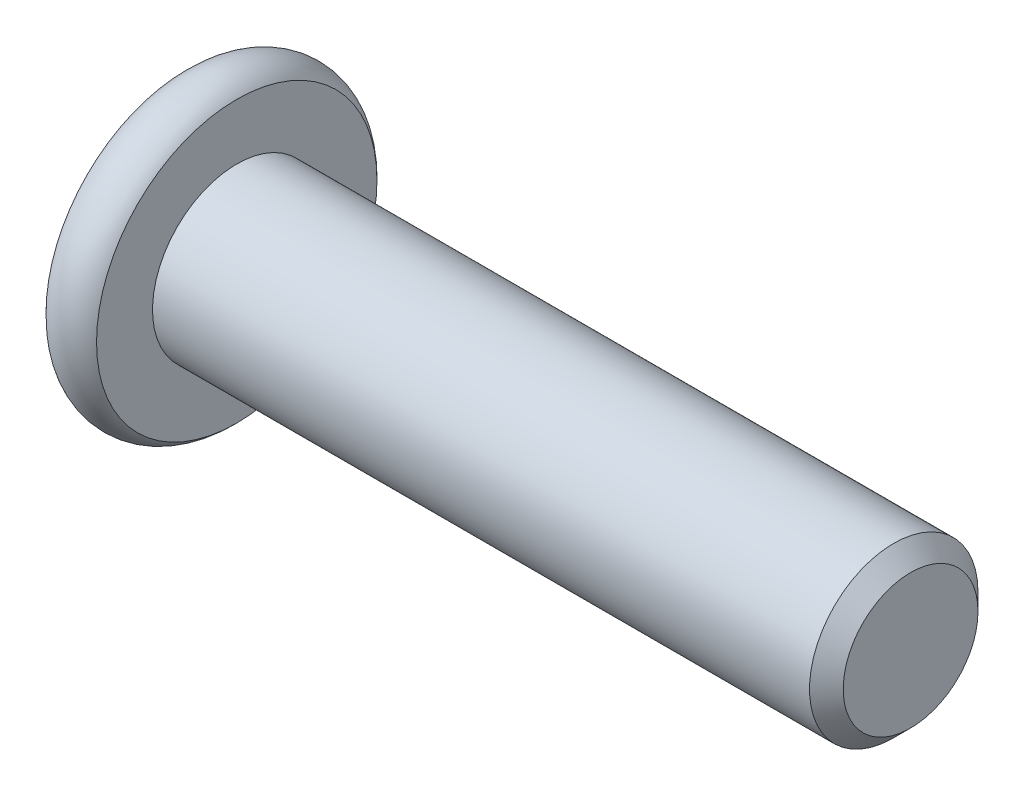
ISO-10303-21;
HEADER;
FILE_DESCRIPTION(('STEP AP214'),'2;1');
FILE_NAME('part.step','',(''),(''),'','','');
FILE_SCHEMA(('AUTOMOTIVE_DESIGN { 1 0 10303 214 1 1 1 1 }'));
ENDSEC;
DATA;
#1=APPLICATION_CONTEXT('core data for automotive mechanical design processes');
#2=APPLICATION_PROTOCOL_DEFINITION('international standard','automotive_design',2000,#1);
#3=PRODUCT_CONTEXT('',#1,'mechanical');
#4=PRODUCT('Part','Part','',(#3));
#5=PRODUCT_RELATED_PRODUCT_CATEGORY('part','',(#4));
#6=PRODUCT_DEFINITION_FORMATION('','',#4);
#7=PRODUCT_DEFINITION_CONTEXT('part definition',#1,'design');
#8=PRODUCT_DEFINITION('design','',#6,#7);
#9=PRODUCT_DEFINITION_SHAPE('','',#8);
#10=(LENGTH_UNIT() NAMED_UNIT(*) SI_UNIT(.MILLI.,.METRE.));
#11=(NAMED_UNIT(*) PLANE_ANGLE_UNIT() SI_UNIT($,.RADIAN.));
#12=(NAMED_UNIT(*) SI_UNIT($,.STERADIAN.) SOLID_ANGLE_UNIT());
#13=UNCERTAINTY_MEASURE_WITH_UNIT(LENGTH_MEASURE(1.E-05),#10,'distance_accuracy_value','');
#14=(GEOMETRIC_REPRESENTATION_CONTEXT(3) GLOBAL_UNCERTAINTY_ASSIGNED_CONTEXT((#13)) GLOBAL_UNIT_ASSIGNED_CONTEXT((#10,
#11,#12)) REPRESENTATION_CONTEXT('',''));
#15=CARTESIAN_POINT('',(0.,0.,0.));
#16=DIRECTION('',(0.,0.,1.));
#17=DIRECTION('',(1.,0.,0.));
#18=AXIS2_PLACEMENT_3D('',#15,#16,#17);
#19=CARTESIAN_POINT('',(-20.,0.,0.));
#20=DIRECTION('',(1.,0.,0.));
#21=DIRECTION('',(0.,0.,-1.));
#22=AXIS2_PLACEMENT_3D('',#19,#20,#21);
#23=CYLINDRICAL_SURFACE('',#22,2.5);
#24=CARTESIAN_POINT('',(-0.5,0.,0.));
#25=DIRECTION('',(1.,0.,0.));
#26=DIRECTION('',(0.,0.,-1.));
#27=AXIS2_PLACEMENT_3D('',#24,#25,#26);
#28=CIRCLE('',#27,2.5);
#29=CARTESIAN_POINT('',(-0.5,0.,-2.5));
#30=VERTEX_POINT('',#29);
#31=EDGE_CURVE('E49',#30,#30,#28,.F.);
#32=ORIENTED_EDGE('',*,*,#31,.T.);
#33=EDGE_LOOP('',(#32));
#34=FACE_BOUND('',#33,.T.);
#35=CARTESIAN_POINT('',(-20.,0.,0.));
#36=DIRECTION('',(-1.,0.,0.));
#37=DIRECTION('',(0.,-1.,0.));
#38=AXIS2_PLACEMENT_3D('',#35,#36,#37);
#39=CIRCLE('',#38,2.5);
#40=CARTESIAN_POINT('',(-20.,-2.50000000000001,0.));
#41=VERTEX_POINT('',#40);
#42=EDGE_CURVE('E134',#41,#41,#39,.F.);
#43=ORIENTED_EDGE('',*,*,#42,.T.);
#44=EDGE_LOOP('',(#43));
#45=FACE_BOUND('',#44,.T.);
#46=ADVANCED_FACE('F35',(#34,#45),#23,.T.);
#47=CARTESIAN_POINT('',(0.,0.,0.));
#48=DIRECTION('',(1.,0.,0.));
#49=DIRECTION('',(0.,0.,-1.));
#50=AXIS2_PLACEMENT_3D('',#47,#48,#49);
#51=PLANE('',#50);
#52=CARTESIAN_POINT('',(0.,0.,0.));
#53=DIRECTION('',(1.,0.,0.));
#54=DIRECTION('',(0.,0.,-1.));
#55=AXIS2_PLACEMENT_3D('',#52,#53,#54);
#56=CIRCLE('',#55,2.);
#57=CARTESIAN_POINT('',(0.,0.,-2.));
#58=VERTEX_POINT('',#57);
#59=EDGE_CURVE('E138',#58,#58,#56,.T.);
#60=ORIENTED_EDGE('',*,*,#59,.T.);
#61=EDGE_LOOP('',(#60));
#62=FACE_BOUND('',#61,.T.);
#63=ADVANCED_FACE('F152',(#62),#51,.T.);
#64=CARTESIAN_POINT('',(0.,0.,0.));
#65=DIRECTION('',(-1.,0.,0.));
#66=DIRECTION('',(0.,0.,1.));
#67=AXIS2_PLACEMENT_3D('',#64,#65,#66);
#68=CONICAL_SURFACE('',#67,2.,0.785398163397446);
#69=ORIENTED_EDGE('',*,*,#31,.F.);
#70=EDGE_LOOP('',(#69));
#71=FACE_BOUND('',#70,.T.);
#72=ORIENTED_EDGE('',*,*,#59,.F.);
#73=EDGE_LOOP('',(#72));
#74=FACE_BOUND('',#73,.T.);
#75=ADVANCED_FACE('F37',(#71,#74),#68,.T.);
#76=CARTESIAN_POINT('',(-21.5,0.,0.));
#77=DIRECTION('',(1.,0.,0.));
#78=DIRECTION('',(0.,1.,0.));
#79=AXIS2_PLACEMENT_3D('',#76,#77,#78);
#80=PLANE('',#79);
#81=CARTESIAN_POINT('',(-21.5,0.,0.));
#82=DIRECTION('',(-1.,0.,0.));
#83=DIRECTION('',(0.,-1.,0.));
#84=AXIS2_PLACEMENT_3D('',#81,#82,#83);
#85=CIRCLE('',#84,1.78205080756887);
#86=CARTESIAN_POINT('',(-21.5,-1.78205080756882,0.));
#87=VERTEX_POINT('',#86);
#88=EDGE_CURVE('E374',#87,#87,#85,.T.);
#89=ORIENTED_EDGE('',*,*,#88,.F.);
#90=EDGE_LOOP('',(#89));
#91=FACE_BOUND('',#90,.T.);
#92=CARTESIAN_POINT('',(-21.5,0.,0.));
#93=DIRECTION('',(-1.,0.,0.));
#94=DIRECTION('',(0.,-1.,0.));
#95=AXIS2_PLACEMENT_3D('',#92,#93,#94);
#96=CIRCLE('',#95,4.16143782776615);
#97=CARTESIAN_POINT('',(-21.5,-4.16143782776615,0.));
#98=VERTEX_POINT('',#97);
#99=EDGE_CURVE('E130',#98,#98,#96,.T.);
#100=ORIENTED_EDGE('',*,*,#99,.T.);
#101=EDGE_LOOP('',(#100));
#102=FACE_BOUND('',#101,.T.);
#103=ADVANCED_FACE('F151',(#91,#102),#80,.F.);
#104=CARTESIAN_POINT('',(-20.75,0.,0.));
#105=DIRECTION('',(-1.,0.,0.));
#106=DIRECTION('',(0.,-1.,0.));
#107=AXIS2_PLACEMENT_3D('',#104,#105,#106);
#108=TOROIDAL_SURFACE('',#107,3.5,1.);
#109=ORIENTED_EDGE('',*,*,#99,.F.);
#110=EDGE_LOOP('',(#109));
#111=FACE_BOUND('',#110,.T.);
#112=CARTESIAN_POINT('',(-20.,0.,0.));
#113=DIRECTION('',(-1.,0.,0.));
#114=DIRECTION('',(0.,-1.,0.));
#115=AXIS2_PLACEMENT_3D('',#112,#113,#114);
#116=CIRCLE('',#115,4.16143782776615);
#117=CARTESIAN_POINT('',(-20.,-4.16143782776615,0.));
#118=VERTEX_POINT('',#117);
#119=EDGE_CURVE('E126',#118,#118,#116,.T.);
#120=ORIENTED_EDGE('',*,*,#119,.T.);
#121=EDGE_LOOP('',(#120));
#122=FACE_BOUND('',#121,.T.);
#123=ADVANCED_FACE('F163',(#111,#122),#108,.T.);
#124=CARTESIAN_POINT('',(-20.,4.16143782776615,0.));
#125=DIRECTION('',(-1.,0.,0.));
#126=DIRECTION('',(0.,-1.,0.));
#127=AXIS2_PLACEMENT_3D('',#124,#125,#126);
#128=PLANE('',#127);
#129=ORIENTED_EDGE('',*,*,#42,.F.);
#130=EDGE_LOOP('',(#129));
#131=FACE_BOUND('',#130,.T.);
#132=ORIENTED_EDGE('',*,*,#119,.F.);
#133=EDGE_LOOP('',(#132));
#134=FACE_BOUND('',#133,.T.);
#135=ADVANCED_FACE('F167',(#131,#134),#128,.F.);
#136=CARTESIAN_POINT('',(-21.5,0.,0.));
#137=DIRECTION('',(-1.,0.,0.));
#138=DIRECTION('',(0.,-1.,0.));
#139=AXIS2_PLACEMENT_3D('',#136,#137,#138);
#140=CONICAL_SURFACE('',#139,1.78205080756887,0.78539816339745);
#141=ORIENTED_EDGE('',*,*,#88,.T.);
#142=EDGE_LOOP('',(#141));
#143=FACE_BOUND('',#142,.T.);
#144=CARTESIAN_POINT('',(-22.0154280856129,-1.74023253176571,1.5));
#145=CARTESIAN_POINT('',(-21.9833811073445,-1.69791724929724,1.5));
#146=CARTESIAN_POINT('',(-21.951644467284,-1.65536760966786,1.5));
#147=CARTESIAN_POINT('',(-21.8889203936152,-1.56970398156679,1.5));
#148=CARTESIAN_POINT('',(-21.8579331482199,-1.52658985542843,1.5));
#149=CARTESIAN_POINT('',(-21.7658461643449,-1.39562626326558,1.5));
#150=CARTESIAN_POINT('',(-21.7061145123021,-1.30679868010571,1.5));
#151=CARTESIAN_POINT('',(-21.5887342891012,-1.1204462264021,1.5));
#152=CARTESIAN_POINT('',(-21.5314082774822,-1.02271587306668,1.5));
#153=CARTESIAN_POINT('',(-21.4264632149759,-0.822357214965221,1.5));
#154=CARTESIAN_POINT('',(-21.3788114236896,-0.719746931701887,1.5));
#155=CARTESIAN_POINT('',(-21.320509988315,-0.565852387095064,1.5));
#156=CARTESIAN_POINT('',(-21.3037990535409,-0.516874191424654,1.5));
#157=CARTESIAN_POINT('',(-21.2743077515089,-0.417723988457495,1.5));
#158=CARTESIAN_POINT('',(-21.2615276514219,-0.367551900263862,1.5));
#159=CARTESIAN_POINT('',(-21.2407784202458,-0.267158299056115,1.5));
#160=CARTESIAN_POINT('',(-21.2327260618259,-0.216954261864852,1.5));
#161=CARTESIAN_POINT('',(-21.221591636834,-0.115994915871319,1.5));
#162=CARTESIAN_POINT('',(-21.2185086886377,-0.0652397064615372,1.5));
#163=CARTESIAN_POINT('',(-21.2175473897404,0.0344222234875568,1.5));
#164=CARTESIAN_POINT('',(-21.2194789216951,0.0833271701100899,1.5));
#165=CARTESIAN_POINT('',(-21.2280175729677,0.180724293127221,1.5));
#166=CARTESIAN_POINT('',(-21.234625142048,0.229216429361728,1.5));
#167=CARTESIAN_POINT('',(-21.2522650626447,0.326258027697005,1.5));
#168=CARTESIAN_POINT('',(-21.263373168201,0.374793507450025,1.5));
#169=CARTESIAN_POINT('',(-21.2894198669595,0.470802295834177,1.5));
#170=CARTESIAN_POINT('',(-21.3043581560035,0.518275688481279,1.5));
#171=CARTESIAN_POINT('',(-21.356839545716,0.667150562065128,1.5));
#172=CARTESIAN_POINT('',(-21.4003351165442,0.766448362426848,1.5));
#173=CARTESIAN_POINT('',(-21.4970587814836,0.960384405673837,1.5));
#174=CARTESIAN_POINT('',(-21.5503217226675,1.05500437383621,1.5));
#175=CARTESIAN_POINT('',(-21.6602258010453,1.23584520321532,1.5));
#176=CARTESIAN_POINT('',(-21.7165682531046,1.3222498694655,1.5));
#177=CARTESIAN_POINT('',(-21.803675572597,1.44954953726474,1.5));
#178=CARTESIAN_POINT('',(-21.8330199906839,1.49143368482424,1.5));
#179=CARTESIAN_POINT('',(-21.8924869182931,1.57462914783245,1.5));
#180=CARTESIAN_POINT('',(-21.9226092115007,1.6159406177258,1.5));
#181=CARTESIAN_POINT('',(-21.9530541181366,1.65701358742554,1.5));
#182=B_SPLINE_CURVE_WITH_KNOTS('',3,(#144,#145,#146,#147,#148,#149,#150,#151,#152,#153,#154,
#155,#156,#157,#158,#159,#160,#161,#162,#163,#164,#165,#166,#167,#168,#169,#170,#171,#172,#173,
#174,#175,#176,#177,#178,#179,#180,#181),.UNSPECIFIED.,.F.,.F.,(4,2,2,2,2,2,2,2,2,2,2,2,2,2,2,2,
2,2,4),(0.,0.159238974218345,0.318517535014529,0.639504781932359,0.979137893799156,
1.31760168934352,1.47272233841618,1.62785352839769,1.7801648653734,1.93244917778272,
2.0790448626029,2.22565464958325,2.37484213303391,2.52401777304032,2.84828365283768,
3.17372975666743,3.4830303053053,3.63644667013902,3.78982082222906),.UNSPECIFIED.);
#183=CARTESIAN_POINT('',(-21.45,-0.866025403784357,1.5));
#184=VERTEX_POINT('',#183);
#185=CARTESIAN_POINT('',(-21.45,0.866025403784521,1.5));
#186=VERTEX_POINT('',#185);
#187=EDGE_CURVE('E104',#184,#186,#182,.T.);
#188=ORIENTED_EDGE('',*,*,#187,.F.);
#189=CARTESIAN_POINT('',(-21.4501154816001,-1.73216627762263,-0.000200000000000827));
#190=CARTESIAN_POINT('',(-21.4203654760673,-1.70239359975907,0.0513677907370736));
#191=CARTESIAN_POINT('',(-21.3923624839103,-1.67212305186347,0.103797917665197));
#192=CARTESIAN_POINT('',(-21.3410892304401,-1.61039789003611,0.210709034055591));
#193=CARTESIAN_POINT('',(-21.3178475050444,-1.57893740312606,0.265200195814655));
#194=CARTESIAN_POINT('',(-21.2780337289922,-1.5154987989798,0.37507908135724));
#195=CARTESIAN_POINT('',(-21.2613615856709,-1.48353684526803,0.43043880909519));
#196=CARTESIAN_POINT('',(-21.2356744568181,-1.41890915196204,0.542377257477138));
#197=CARTESIAN_POINT('',(-21.2266402904788,-1.38624538781111,0.598952556552995));
#198=CARTESIAN_POINT('',(-21.2184890812268,-1.32995210095292,0.696455389516425));
#199=CARTESIAN_POINT('',(-21.2172822529892,-1.30639533311117,0.737256908280449));
#200=CARTESIAN_POINT('',(-21.2193140571623,-1.25932335290186,0.81878796961584));
#201=CARTESIAN_POINT('',(-21.2225536707483,-1.23580815085306,0.859517494314611));
#202=CARTESIAN_POINT('',(-21.2332919859819,-1.1890041497842,0.940584402163395));
#203=CARTESIAN_POINT('',(-21.2407946530187,-1.16571558211713,0.980921384598266));
#204=CARTESIAN_POINT('',(-21.2596516119283,-1.11952932016328,1.06091833691401));
#205=CARTESIAN_POINT('',(-21.2710075570186,-1.0966317980878,1.10057800851618));
#206=CARTESIAN_POINT('',(-21.3047216475927,-1.03798159809691,1.20216313477446));
#207=CARTESIAN_POINT('',(-21.3296218490933,-1.00259267147458,1.26345855370967));
#208=CARTESIAN_POINT('',(-21.3716566532716,-0.950557780604299,1.3535856284633));
#209=CARTESIAN_POINT('',(-21.3864251535591,-0.93341075967707,1.38328513990771));
#210=CARTESIAN_POINT('',(-21.4173105659402,-0.899432101996327,1.44213790138375));
#211=CARTESIAN_POINT('',(-21.4334268341217,-0.882600319285629,1.47129140422064));
#212=CARTESIAN_POINT('',(-21.4501154816001,-0.865909933730519,1.5002));
#213=B_SPLINE_CURVE_WITH_KNOTS('',3,(#189,#190,#191,#192,#193,#194,#195,#196,#197,#198,#199,
#200,#201,#202,#203,#204,#205,#206,#207,#208,#209,#210,#211,#212),.UNSPECIFIED.,.F.,.F.,(4,2,2,
2,2,2,2,2,2,2,2,4),(0.,0.1998291436933,0.400822987382381,0.598623720538169,0.795926240188872,
0.937113067959861,1.0783310557719,1.21968061668219,1.36109089931051,1.58570969637564,
1.69770705470963,1.80965120737194),.UNSPECIFIED.);
#214=CARTESIAN_POINT('',(-21.45,-1.73205080756879,0.));
#215=VERTEX_POINT('',#214);
#216=EDGE_CURVE('E209',#215,#184,#213,.T.);
#217=ORIENTED_EDGE('',*,*,#216,.F.);
#218=CARTESIAN_POINT('',(-21.4501154816001,-0.865909933730518,-1.5002));
#219=CARTESIAN_POINT('',(-21.4203654760673,-0.895682611594083,-1.44863220926292));
#220=CARTESIAN_POINT('',(-21.3923624839103,-0.925953159489683,-1.3962020823348));
#221=CARTESIAN_POINT('',(-21.3410892304401,-0.987678321317044,-1.2892909659444));
#222=CARTESIAN_POINT('',(-21.3178475050444,-1.0191388082271,-1.23479980418533));
#223=CARTESIAN_POINT('',(-21.2780337289922,-1.08257741237337,-1.12492091864274));
#224=CARTESIAN_POINT('',(-21.2613615856709,-1.11453936608514,-1.06956119090479));
#225=CARTESIAN_POINT('',(-21.2356744568181,-1.17916705939113,-0.95762274252284));
#226=CARTESIAN_POINT('',(-21.2266402904788,-1.21183082354206,-0.901047443446981));
#227=CARTESIAN_POINT('',(-21.2184890812268,-1.26812411040025,-0.803544610483548));
#228=CARTESIAN_POINT('',(-21.2172822529892,-1.291680878242,-0.762743091719523));
#229=CARTESIAN_POINT('',(-21.2193140571623,-1.33875285845131,-0.681212030384133));
#230=CARTESIAN_POINT('',(-21.2225536707483,-1.36226806050011,-0.640482505685362));
#231=CARTESIAN_POINT('',(-21.2332919859819,-1.40907206156897,-0.559415597836578));
#232=CARTESIAN_POINT('',(-21.2407946530187,-1.43236062923604,-0.519078615401706));
#233=CARTESIAN_POINT('',(-21.2596516119283,-1.47854689118989,-0.439081663085965));
#234=CARTESIAN_POINT('',(-21.2710075570186,-1.50144441326537,-0.399421991483789));
#235=CARTESIAN_POINT('',(-21.3047216475926,-1.56009461325625,-0.297836865225513));
#236=CARTESIAN_POINT('',(-21.3296218490933,-1.59548353987858,-0.236541446290309));
#237=CARTESIAN_POINT('',(-21.3716566532716,-1.64751843074886,-0.146414371536686));
#238=CARTESIAN_POINT('',(-21.3864251535591,-1.66466545167609,-0.116714860092282));
#239=CARTESIAN_POINT('',(-21.4173105659401,-1.69864410935683,-0.0578620986162497));
#240=CARTESIAN_POINT('',(-21.4334268341217,-1.71547589206752,-0.0287085957793635));
#241=CARTESIAN_POINT('',(-21.4501154816001,-1.73216627762263,0.000199999999999412));
#242=B_SPLINE_CURVE_WITH_KNOTS('',3,(#218,#219,#220,#221,#222,#223,#224,#225,#226,#227,#228,
#229,#230,#231,#232,#233,#234,#235,#236,#237,#238,#239,#240,#241),.UNSPECIFIED.,.F.,.F.,(4,2,2,
2,2,2,2,2,2,2,2,4),(0.,0.199829143693309,0.400822987382399,0.598623720538195,0.795926240188908,
0.937113067959897,1.07833105577194,1.21968061668223,1.36109089931055,1.58570969637566,
1.69770705470964,1.80965120737194),.UNSPECIFIED.);
#243=CARTESIAN_POINT('',(-21.45,-0.866025403784356,-1.5));
#244=VERTEX_POINT('',#243);
#245=EDGE_CURVE('E204',#244,#215,#242,.T.);
#246=ORIENTED_EDGE('',*,*,#245,.F.);
#247=CARTESIAN_POINT('',(-22.0154280857207,-1.74023253190804,-1.5));
#248=CARTESIAN_POINT('',(-21.9833811074481,-1.69791724943556,-1.5));
#249=CARTESIAN_POINT('',(-21.9516444673835,-1.65536760980215,-1.5));
#250=CARTESIAN_POINT('',(-21.8889203937065,-1.56970398169299,-1.5));
#251=CARTESIAN_POINT('',(-21.857933148307,-1.52658985555056,-1.5));
#252=CARTESIAN_POINT('',(-21.7658461644196,-1.39562626337526,-1.5));
#253=CARTESIAN_POINT('',(-21.7061145123685,-1.30679868020693,-1.5));
#254=CARTESIAN_POINT('',(-21.5887342891506,-1.12044622648487,-1.5));
#255=CARTESIAN_POINT('',(-21.5314082775229,-1.02271587313941,-1.5));
#256=CARTESIAN_POINT('',(-21.4264632150005,-0.82235721501701,-1.5));
#257=CARTESIAN_POINT('',(-21.3788114237067,-0.719746931742787,-1.5));
#258=CARTESIAN_POINT('',(-21.3205099883267,-0.565852387127782,-1.5));
#259=CARTESIAN_POINT('',(-21.3037990535528,-0.516874191460818,-1.5));
#260=CARTESIAN_POINT('',(-21.2743077515206,-0.417723988500667,-1.5));
#261=CARTESIAN_POINT('',(-21.2615276514332,-0.367551900310598,-1.5));
#262=CARTESIAN_POINT('',(-21.2407784202553,-0.267158299109861,-1.5));
#263=CARTESIAN_POINT('',(-21.2327260618342,-0.216954261922043,-1.5));
#264=CARTESIAN_POINT('',(-21.2215916368391,-0.11599491593529,-1.5));
#265=CARTESIAN_POINT('',(-21.2185086886407,-0.0652397065288419,-1.5));
#266=CARTESIAN_POINT('',(-21.2175473897388,0.0344222234141835,-1.5));
#267=CARTESIAN_POINT('',(-21.219478921691,0.0833271700339729,-1.5));
#268=CARTESIAN_POINT('',(-21.228017572958,0.180724293045896,-1.5));
#269=CARTESIAN_POINT('',(-21.2346251420354,0.229216429277938,-1.5));
#270=CARTESIAN_POINT('',(-21.2522650626259,0.326258027608351,-1.5));
#271=CARTESIAN_POINT('',(-21.2633731681789,0.374793507358977,-1.5));
#272=CARTESIAN_POINT('',(-21.2894198669309,0.470802295738578,-1.5));
#273=CARTESIAN_POINT('',(-21.3043581559716,0.518275688383522,-1.5));
#274=CARTESIAN_POINT('',(-21.3568395456685,0.667150561946175,-1.5));
#275=CARTESIAN_POINT('',(-21.4003351164824,0.76644836228992,-1.5));
#276=CARTESIAN_POINT('',(-21.4970587813916,0.960384405502337,-1.5));
#277=CARTESIAN_POINT('',(-21.5503217225595,1.05500437364812,-1.5));
#278=CARTESIAN_POINT('',(-21.6602258009069,1.23584520299742,-1.5));
#279=CARTESIAN_POINT('',(-21.7165682529518,1.32224986923427,-1.5));
#280=CARTESIAN_POINT('',(-21.8036755724226,1.44954953701379,-1.5));
#281=CARTESIAN_POINT('',(-21.8330199905024,1.49143368456681,-1.5));
#282=CARTESIAN_POINT('',(-21.8924869180973,1.57462914756211,-1.5));
#283=CARTESIAN_POINT('',(-21.9226092112979,1.61594061744903,-1.5));
#284=CARTESIAN_POINT('',(-21.9530541179266,1.65701358714234,-1.5));
#285=B_SPLINE_CURVE_WITH_KNOTS('',3,(#247,#248,#249,#250,#251,#252,#253,#254,#255,#256,#257,
#258,#259,#260,#261,#262,#263,#264,#265,#266,#267,#268,#269,#270,#271,#272,#273,#274,#275,#276,
#277,#278,#279,#280,#281,#282,#283,#284),.UNSPECIFIED.,.F.,.F.,(4,2,2,2,2,2,2,2,2,2,2,2,2,2,2,2,
2,2,4),(0.,0.159238974235473,0.318517535048788,0.63950478200152,0.979137893907475,
1.31760168949062,1.4727223385533,1.62785352852483,1.78016486549098,1.93244917789075,
2.07904486270244,2.22565464967428,2.37484213311578,2.52401777311302,2.84828365284403,
3.17372975660699,3.48303030518774,3.63644666999328,3.78982082205515),.UNSPECIFIED.);
#286=CARTESIAN_POINT('',(-21.45,0.866025403784482,-1.5));
#287=VERTEX_POINT('',#286);
#288=EDGE_CURVE('E56',#287,#244,#285,.F.);
#289=ORIENTED_EDGE('',*,*,#288,.F.);
#290=CARTESIAN_POINT('',(-21.4501154816001,1.7321662776228,0.000200000000000631));
#291=CARTESIAN_POINT('',(-21.4203654760674,1.70239359975923,-0.0513677907370775));
#292=CARTESIAN_POINT('',(-21.3923624839104,1.67212305186363,-0.103797917665205));
#293=CARTESIAN_POINT('',(-21.3410892304402,1.61039789003626,-0.210709034055606));
#294=CARTESIAN_POINT('',(-21.3178475050444,1.57893740312621,-0.265200195814673));
#295=CARTESIAN_POINT('',(-21.2780337289922,1.51549879897993,-0.375079081357266));
#296=CARTESIAN_POINT('',(-21.2613615856709,1.48353684526816,-0.43043880909522));
#297=CARTESIAN_POINT('',(-21.2356744568181,1.41890915196217,-0.542377257477176));
#298=CARTESIAN_POINT('',(-21.2266402904789,1.38624538781123,-0.598952556553036));
#299=CARTESIAN_POINT('',(-21.2184890812269,1.32995210095304,-0.696455389516471));
#300=CARTESIAN_POINT('',(-21.2172822529892,1.30639533311128,-0.737256908280496));
#301=CARTESIAN_POINT('',(-21.2193140571623,1.25932335290198,-0.818787969615889));
#302=CARTESIAN_POINT('',(-21.2225536707483,1.23580815085317,-0.859517494314661));
#303=CARTESIAN_POINT('',(-21.233291985982,1.1890041497843,-0.940584402163447));
#304=CARTESIAN_POINT('',(-21.2407946530188,1.16571558211723,-0.98092138459832));
#305=CARTESIAN_POINT('',(-21.2596516119283,1.11952932016339,-1.06091833691406));
#306=CARTESIAN_POINT('',(-21.2710075570186,1.0966317980879,-1.10057800851624));
#307=CARTESIAN_POINT('',(-21.3047216475927,1.03798159809702,-1.20216313477451));
#308=CARTESIAN_POINT('',(-21.3296218490934,1.00259267147469,-1.26345855370971));
#309=CARTESIAN_POINT('',(-21.3716566532716,0.950557780604414,-1.35358562846333));
#310=CARTESIAN_POINT('',(-21.3864251535591,0.933410759677188,-1.38328513990773));
#311=CARTESIAN_POINT('',(-21.4173105659402,0.899432101996449,-1.44213790138376));
#312=CARTESIAN_POINT('',(-21.4334268341217,0.882600319285753,-1.47129140422064));
#313=CARTESIAN_POINT('',(-21.4501154816001,0.865909933730644,-1.5002));
#314=B_SPLINE_CURVE_WITH_KNOTS('',3,(#290,#291,#292,#293,#294,#295,#296,#297,#298,#299,#300,
#301,#302,#303,#304,#305,#306,#307,#308,#309,#310,#311,#312,#313),.UNSPECIFIED.,.F.,.F.,(4,2,2,
2,2,2,2,2,2,2,2,4),(0.,0.199829143693318,0.400822987382415,0.598623720538219,0.795926240188938,
0.937113067959932,1.07833105577198,1.21968061668227,1.3610908993106,1.58570969637569,
1.69770705470966,1.80965120737196),.UNSPECIFIED.);
#315=CARTESIAN_POINT('',(-21.45,1.73205080756896,0.));
#316=VERTEX_POINT('',#315);
#317=EDGE_CURVE('E11',#316,#287,#314,.T.);
#318=ORIENTED_EDGE('',*,*,#317,.F.);
#319=CARTESIAN_POINT('',(-21.4501154816001,0.865909933730683,1.5002));
#320=CARTESIAN_POINT('',(-21.4203654760674,0.895682611594248,1.44863220926292));
#321=CARTESIAN_POINT('',(-21.3923624839103,0.925953159489847,1.3962020823348));
#322=CARTESIAN_POINT('',(-21.3410892304402,0.987678321317204,1.28929096594441));
#323=CARTESIAN_POINT('',(-21.3178475050444,1.01913880822725,1.23479980418534));
#324=CARTESIAN_POINT('',(-21.2780337289923,1.08257741237352,1.12492091864276));
#325=CARTESIAN_POINT('',(-21.2613615856709,1.11453936608529,1.06956119090481));
#326=CARTESIAN_POINT('',(-21.2356744568181,1.17916705939128,0.957622742522858));
#327=CARTESIAN_POINT('',(-21.2266402904789,1.21183082354221,0.901047443447));
#328=CARTESIAN_POINT('',(-21.2184890812269,1.2681241104004,0.803544610483568));
#329=CARTESIAN_POINT('',(-21.2172822529893,1.29168087824215,0.762743091719542));
#330=CARTESIAN_POINT('',(-21.2193140571623,1.33875285845146,0.681212030384148));
#331=CARTESIAN_POINT('',(-21.2225536707483,1.36226806050026,0.640482505685376));
#332=CARTESIAN_POINT('',(-21.233291985982,1.40907206156913,0.559415597836588));
#333=CARTESIAN_POINT('',(-21.2407946530188,1.4323606292362,0.519078615401716));
#334=CARTESIAN_POINT('',(-21.2596516119283,1.47854689119004,0.439081663085971));
#335=CARTESIAN_POINT('',(-21.2710075570186,1.50144441326553,0.399421991483793));
#336=CARTESIAN_POINT('',(-21.3047216475927,1.56009461325641,0.297836865225515));
#337=CARTESIAN_POINT('',(-21.3296218490934,1.59548353987874,0.236541446290312));
#338=CARTESIAN_POINT('',(-21.3716566532716,1.64751843074902,0.146414371536688));
#339=CARTESIAN_POINT('',(-21.3864251535591,1.66466545167625,0.116714860092283));
#340=CARTESIAN_POINT('',(-21.4173105659402,1.69864410935699,0.0578620986162498));
#341=CARTESIAN_POINT('',(-21.4334268341218,1.71547589206769,0.0287085957793632));
#342=CARTESIAN_POINT('',(-21.4501154816001,1.7321662776228,-0.000199999999999863));
#343=B_SPLINE_CURVE_WITH_KNOTS('',3,(#319,#320,#321,#322,#323,#324,#325,#326,#327,#328,#329,
#330,#331,#332,#333,#334,#335,#336,#337,#338,#339,#340,#341,#342),.UNSPECIFIED.,.F.,.F.,(4,2,2,
2,2,2,2,2,2,2,2,4),(0.,0.1998291436933,0.400822987382378,0.598623720538167,0.795926240188873,
0.937113067959867,1.07833105577192,1.21968061668221,1.36109089931054,1.58570969637565,
1.69770705470963,1.80965120737193),.UNSPECIFIED.);
#344=EDGE_CURVE('E94',#186,#316,#343,.T.);
#345=ORIENTED_EDGE('',*,*,#344,.F.);
#346=EDGE_LOOP('',(#188,#217,#246,#289,#318,#345));
#347=FACE_BOUND('',#346,.T.);
#348=ADVANCED_FACE('F93',(#143,#347),#140,.F.);
#349=CARTESIAN_POINT('',(-19.2,0.,0.));
#350=DIRECTION('',(-1.,0.,0.));
#351=DIRECTION('',(0.,-1.,0.));
#352=AXIS2_PLACEMENT_3D('',#349,#350,#351);
#353=PLANE('',#352);
#354=DIRECTION('',(0.,0.5,-0.866025403784438));
#355=VECTOR('',#354,1.);
#356=CARTESIAN_POINT('',(-19.2,0.866025403784513,1.5));
#357=LINE('',#356,#355);
#358=CARTESIAN_POINT('',(-19.2,0.866025403784513,1.5));
#359=VERTEX_POINT('',#358);
#360=CARTESIAN_POINT('',(-19.2,1.73205080756895,0.));
#361=VERTEX_POINT('',#360);
#362=EDGE_CURVE('E103',#359,#361,#357,.T.);
#363=ORIENTED_EDGE('',*,*,#362,.T.);
#364=DIRECTION('',(0.,-0.500000000000017,-0.866025403784429));
#365=VECTOR('',#364,1.);
#366=CARTESIAN_POINT('',(-19.2,1.73205080756895,0.));
#367=LINE('',#366,#365);
#368=CARTESIAN_POINT('',(-19.2,0.866025403784474,-1.5));
#369=VERTEX_POINT('',#368);
#370=EDGE_CURVE('E108',#361,#369,#367,.T.);
#371=ORIENTED_EDGE('',*,*,#370,.T.);
#372=DIRECTION('',(0.,-1.,0.));
#373=VECTOR('',#372,1.);
#374=CARTESIAN_POINT('',(-19.2,0.866025403784474,-1.5));
#375=LINE('',#374,#373);
#376=CARTESIAN_POINT('',(-19.2,-0.866025403784365,-1.5));
#377=VERTEX_POINT('',#376);
#378=EDGE_CURVE('E235',#369,#377,#375,.T.);
#379=ORIENTED_EDGE('',*,*,#378,.T.);
#380=DIRECTION('',(0.,-0.5,0.866025403784438));
#381=VECTOR('',#380,1.);
#382=CARTESIAN_POINT('',(-19.2,-0.866025403784365,-1.5));
#383=LINE('',#382,#381);
#384=CARTESIAN_POINT('',(-19.2,-1.7320508075688,0.));
#385=VERTEX_POINT('',#384);
#386=EDGE_CURVE('E240',#377,#385,#383,.T.);
#387=ORIENTED_EDGE('',*,*,#386,.T.);
#388=DIRECTION('',(0.,0.5,0.866025403784439));
#389=VECTOR('',#388,1.);
#390=CARTESIAN_POINT('',(-19.2,-1.7320508075688,0.));
#391=LINE('',#390,#389);
#392=CARTESIAN_POINT('',(-19.2,-0.866025403784366,1.5));
#393=VERTEX_POINT('',#392);
#394=EDGE_CURVE('E122',#385,#393,#391,.T.);
#395=ORIENTED_EDGE('',*,*,#394,.T.);
#396=DIRECTION('',(0.,1.,0.));
#397=VECTOR('',#396,1.);
#398=CARTESIAN_POINT('',(-19.2,-0.866025403784366,1.5));
#399=LINE('',#398,#397);
#400=EDGE_CURVE('E112',#393,#359,#399,.T.);
#401=ORIENTED_EDGE('',*,*,#400,.T.);
#402=EDGE_LOOP('',(#363,#371,#379,#387,#395,#401));
#403=FACE_BOUND('',#402,.T.);
#404=ADVANCED_FACE('F191',(#403),#353,.T.);
#405=CARTESIAN_POINT('',(-19.2,1.73205080756895,0.));
#406=DIRECTION('',(0.,0.866025403784429,-0.500000000000017));
#407=DIRECTION('',(0.,0.500000000000017,0.866025403784429));
#408=AXIS2_PLACEMENT_3D('',#405,#406,#407);
#409=PLANE('',#408);
#410=DIRECTION('',(-1.,0.,0.));
#411=VECTOR('',#410,1.);
#412=CARTESIAN_POINT('',(-19.2,1.73205080756895,0.));
#413=LINE('',#412,#411);
#414=EDGE_CURVE('E100',#361,#316,#413,.T.);
#415=ORIENTED_EDGE('',*,*,#414,.T.);
#416=ORIENTED_EDGE('',*,*,#317,.T.);
#417=DIRECTION('',(-1.,0.,0.));
#418=VECTOR('',#417,1.);
#419=CARTESIAN_POINT('',(-19.2,0.866025403784474,-1.5));
#420=LINE('',#419,#418);
#421=EDGE_CURVE('E111',#369,#287,#420,.T.);
#422=ORIENTED_EDGE('',*,*,#421,.F.);
#423=ORIENTED_EDGE('',*,*,#370,.F.);
#424=EDGE_LOOP('',(#415,#416,#422,#423));
#425=FACE_BOUND('',#424,.T.);
#426=ADVANCED_FACE('F106',(#425),#409,.F.);
#427=CARTESIAN_POINT('',(-19.2,0.866025403784474,-1.5));
#428=DIRECTION('',(0.,0.,-1.));
#429=DIRECTION('',(0.,1.,0.));
#430=AXIS2_PLACEMENT_3D('',#427,#428,#429);
#431=PLANE('',#430);
#432=ORIENTED_EDGE('',*,*,#421,.T.);
#433=ORIENTED_EDGE('',*,*,#288,.T.);
#434=DIRECTION('',(-1.,0.,0.));
#435=VECTOR('',#434,1.);
#436=CARTESIAN_POINT('',(-19.2,-0.866025403784365,-1.5));
#437=LINE('',#436,#435);
#438=EDGE_CURVE('E118',#377,#244,#437,.T.);
#439=ORIENTED_EDGE('',*,*,#438,.F.);
#440=ORIENTED_EDGE('',*,*,#378,.F.);
#441=EDGE_LOOP('',(#432,#433,#439,#440));
#442=FACE_BOUND('',#441,.T.);
#443=ADVANCED_FACE('F224',(#442),#431,.F.);
#444=CARTESIAN_POINT('',(-19.2,-0.866025403784365,-1.5));
#445=DIRECTION('',(0.,-0.866025403784439,-0.5));
#446=DIRECTION('',(0.,0.5,-0.866025403784439));
#447=AXIS2_PLACEMENT_3D('',#444,#445,#446);
#448=PLANE('',#447);
#449=ORIENTED_EDGE('',*,*,#438,.T.);
#450=ORIENTED_EDGE('',*,*,#245,.T.);
#451=DIRECTION('',(-1.,0.,0.));
#452=VECTOR('',#451,1.);
#453=CARTESIAN_POINT('',(-19.2,-1.7320508075688,0.));
#454=LINE('',#453,#452);
#455=EDGE_CURVE('E256',#385,#215,#454,.T.);
#456=ORIENTED_EDGE('',*,*,#455,.F.);
#457=ORIENTED_EDGE('',*,*,#386,.F.);
#458=EDGE_LOOP('',(#449,#450,#456,#457));
#459=FACE_BOUND('',#458,.T.);
#460=ADVANCED_FACE('F219',(#459),#448,.F.);
#461=CARTESIAN_POINT('',(-19.2,-1.7320508075688,0.));
#462=DIRECTION('',(0.,-0.866025403784439,0.5));
#463=DIRECTION('',(0.,-0.5,-0.866025403784439));
#464=AXIS2_PLACEMENT_3D('',#461,#462,#463);
#465=PLANE('',#464);
#466=ORIENTED_EDGE('',*,*,#455,.T.);
#467=ORIENTED_EDGE('',*,*,#216,.T.);
#468=DIRECTION('',(-1.,0.,0.));
#469=VECTOR('',#468,1.);
#470=CARTESIAN_POINT('',(-19.2,-0.866025403784366,1.5));
#471=LINE('',#470,#469);
#472=EDGE_CURVE('E253',#393,#184,#471,.T.);
#473=ORIENTED_EDGE('',*,*,#472,.F.);
#474=ORIENTED_EDGE('',*,*,#394,.F.);
#475=EDGE_LOOP('',(#466,#467,#473,#474));
#476=FACE_BOUND('',#475,.T.);
#477=ADVANCED_FACE('F216',(#476),#465,.F.);
#478=CARTESIAN_POINT('',(-19.2,-0.866025403784366,1.5));
#479=DIRECTION('',(0.,0.,1.));
#480=DIRECTION('',(1.,0.,0.));
#481=AXIS2_PLACEMENT_3D('',#478,#479,#480);
#482=PLANE('',#481);
#483=ORIENTED_EDGE('',*,*,#472,.T.);
#484=ORIENTED_EDGE('',*,*,#187,.T.);
#485=DIRECTION('',(-1.,0.,0.));
#486=VECTOR('',#485,1.);
#487=CARTESIAN_POINT('',(-19.2,0.866025403784513,1.5));
#488=LINE('',#487,#486);
#489=EDGE_CURVE('E63',#359,#186,#488,.T.);
#490=ORIENTED_EDGE('',*,*,#489,.F.);
#491=ORIENTED_EDGE('',*,*,#400,.F.);
#492=EDGE_LOOP('',(#483,#484,#490,#491));
#493=FACE_BOUND('',#492,.T.);
#494=ADVANCED_FACE('F174',(#493),#482,.F.);
#495=CARTESIAN_POINT('',(-19.2,0.866025403784513,1.5));
#496=DIRECTION('',(0.,0.866025403784439,0.5));
#497=DIRECTION('',(0.,-0.5,0.866025403784439));
#498=AXIS2_PLACEMENT_3D('',#495,#496,#497);
#499=PLANE('',#498);
#500=ORIENTED_EDGE('',*,*,#489,.T.);
#501=ORIENTED_EDGE('',*,*,#344,.T.);
#502=ORIENTED_EDGE('',*,*,#414,.F.);
#503=ORIENTED_EDGE('',*,*,#362,.F.);
#504=EDGE_LOOP('',(#500,#501,#502,#503));
#505=FACE_BOUND('',#504,.T.);
#506=ADVANCED_FACE('F99',(#505),#499,.F.);
#507=CLOSED_SHELL('',(#46,#63,#75,#103,#123,#135,#348,#404,#426,#443,#460,#477,#494,#506));
#508=MANIFOLD_SOLID_BREP('B2',#507);
#509=ADVANCED_BREP_SHAPE_REPRESENTATION('',(#18,#508),#14);
#510=SHAPE_DEFINITION_REPRESENTATION(#9,#509);
ENDSEC;
END-ISO-10303-21;
